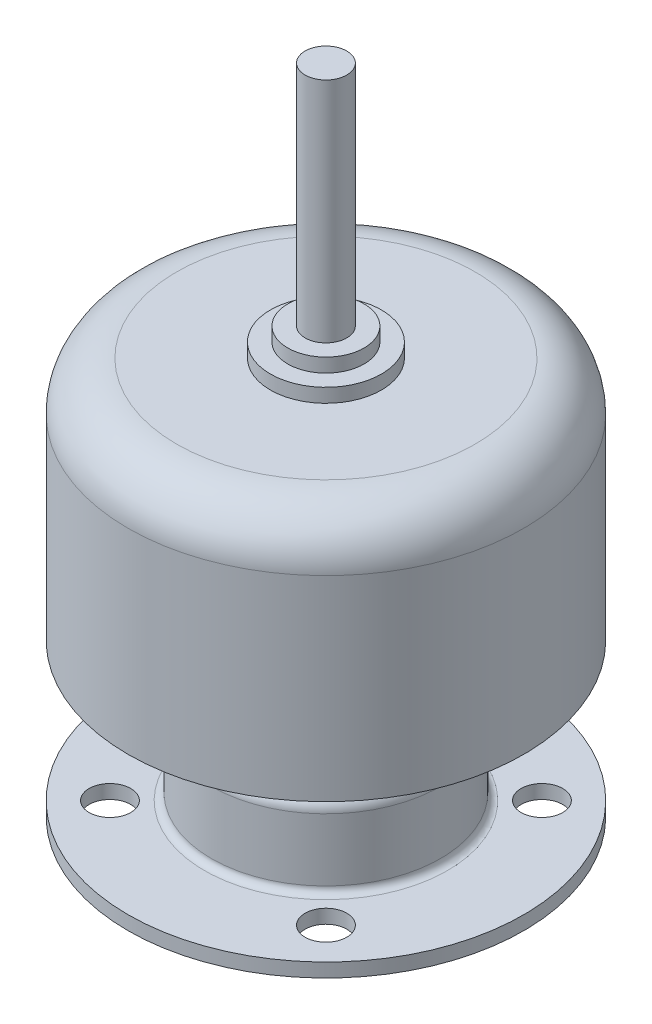
ISO-10303-21;
HEADER;
FILE_DESCRIPTION(('STEP AP214'),'2;1');
FILE_NAME('part.step','',(''),(''),'','','');
FILE_SCHEMA(('AUTOMOTIVE_DESIGN { 1 0 10303 214 1 1 1 1 }'));
ENDSEC;
DATA;
#1=APPLICATION_CONTEXT('core data for automotive mechanical design processes');
#2=APPLICATION_PROTOCOL_DEFINITION('international standard','automotive_design',2000,#1);
#3=PRODUCT_CONTEXT('',#1,'mechanical');
#4=PRODUCT('Part','Part','',(#3));
#5=PRODUCT_RELATED_PRODUCT_CATEGORY('part','',(#4));
#6=PRODUCT_DEFINITION_FORMATION('','',#4);
#7=PRODUCT_DEFINITION_CONTEXT('part definition',#1,'design');
#8=PRODUCT_DEFINITION('design','',#6,#7);
#9=PRODUCT_DEFINITION_SHAPE('','',#8);
#10=(LENGTH_UNIT() NAMED_UNIT(*) SI_UNIT(.MILLI.,.METRE.));
#11=(NAMED_UNIT(*) PLANE_ANGLE_UNIT() SI_UNIT($,.RADIAN.));
#12=(NAMED_UNIT(*) SI_UNIT($,.STERADIAN.) SOLID_ANGLE_UNIT());
#13=UNCERTAINTY_MEASURE_WITH_UNIT(LENGTH_MEASURE(1.E-05),#10,'distance_accuracy_value','');
#14=(GEOMETRIC_REPRESENTATION_CONTEXT(3) GLOBAL_UNCERTAINTY_ASSIGNED_CONTEXT((#13)) GLOBAL_UNIT_ASSIGNED_CONTEXT((#10,
#11,#12)) REPRESENTATION_CONTEXT('',''));
#15=CARTESIAN_POINT('',(0.,0.,0.));
#16=DIRECTION('',(0.,0.,1.));
#17=DIRECTION('',(1.,0.,0.));
#18=AXIS2_PLACEMENT_3D('',#15,#16,#17);
#19=CARTESIAN_POINT('',(0.,11.,0.));
#20=DIRECTION('',(0.,-1.,0.));
#21=DIRECTION('',(0.,0.,-1.));
#22=AXIS2_PLACEMENT_3D('',#19,#20,#21);
#23=PLANE('',#22);
#24=CARTESIAN_POINT('',(0.,11.,0.));
#25=DIRECTION('',(0.,-1.,0.));
#26=DIRECTION('',(0.,0.,-1.));
#27=AXIS2_PLACEMENT_3D('',#24,#25,#26);
#28=CIRCLE('',#27,6.5);
#29=CARTESIAN_POINT('',(0.,11.,6.5));
#30=VERTEX_POINT('',#29);
#31=EDGE_CURVE('E227',#30,#30,#28,.T.);
#32=ORIENTED_EDGE('',*,*,#31,.F.);
#33=EDGE_LOOP('',(#32));
#34=FACE_BOUND('',#33,.T.);
#35=CARTESIAN_POINT('',(0.,11.,0.));
#36=DIRECTION('',(0.,-1.,0.));
#37=DIRECTION('',(0.,0.,-1.));
#38=AXIS2_PLACEMENT_3D('',#35,#36,#37);
#39=CIRCLE('',#38,14.25);
#40=CARTESIAN_POINT('',(0.,11.,14.25));
#41=VERTEX_POINT('',#40);
#42=EDGE_CURVE('E308',#41,#41,#39,.T.);
#43=ORIENTED_EDGE('',*,*,#42,.T.);
#44=EDGE_LOOP('',(#43));
#45=FACE_BOUND('',#44,.T.);
#46=ADVANCED_FACE('F16',(#34,#45),#23,.T.);
#47=CARTESIAN_POINT('',(0.,7.,0.));
#48=DIRECTION('',(0.,1.,0.));
#49=DIRECTION('',(1.,0.,0.));
#50=AXIS2_PLACEMENT_3D('',#47,#48,#49);
#51=PLANE('',#50);
#52=CARTESIAN_POINT('',(0.,7.,0.));
#53=DIRECTION('',(0.,-1.,0.));
#54=DIRECTION('',(0.,0.,-1.));
#55=AXIS2_PLACEMENT_3D('',#52,#53,#54);
#56=CIRCLE('',#55,6.5);
#57=CARTESIAN_POINT('',(0.,7.,6.5));
#58=VERTEX_POINT('',#57);
#59=EDGE_CURVE('E236',#58,#58,#56,.T.);
#60=ORIENTED_EDGE('',*,*,#59,.T.);
#61=EDGE_LOOP('',(#60));
#62=FACE_BOUND('',#61,.T.);
#63=CARTESIAN_POINT('',(0.,7.,0.));
#64=DIRECTION('',(0.,1.,0.));
#65=DIRECTION('',(0.,0.,1.));
#66=AXIS2_PLACEMENT_3D('',#63,#64,#65);
#67=CIRCLE('',#66,7.25);
#68=CARTESIAN_POINT('',(0.,7.,-7.25));
#69=VERTEX_POINT('',#68);
#70=EDGE_CURVE('E186',#69,#69,#67,.T.);
#71=ORIENTED_EDGE('',*,*,#70,.T.);
#72=EDGE_LOOP('',(#71));
#73=FACE_BOUND('',#72,.T.);
#74=ADVANCED_FACE('F367',(#62,#73),#51,.T.);
#75=CARTESIAN_POINT('',(0.,1.,0.));
#76=DIRECTION('',(0.,1.,0.));
#77=DIRECTION('',(1.,0.,0.));
#78=AXIS2_PLACEMENT_3D('',#75,#76,#77);
#79=PLANE('',#78);
#80=CARTESIAN_POINT('',(7.77817459305201,1.,-7.77817459305198));
#81=DIRECTION('',(0.,1.,0.));
#82=DIRECTION('',(0.,0.,1.));
#83=AXIS2_PLACEMENT_3D('',#80,#81,#82);
#84=CIRCLE('',#83,1.50000000000005);
#85=CARTESIAN_POINT('',(7.77817459305201,1.,-6.27817459305193));
#86=VERTEX_POINT('',#85);
#87=EDGE_CURVE('E320',#86,#86,#84,.T.);
#88=ORIENTED_EDGE('',*,*,#87,.F.);
#89=EDGE_LOOP('',(#88));
#90=FACE_BOUND('',#89,.T.);
#91=CARTESIAN_POINT('',(-7.77817459305201,1.,7.77817459305203));
#92=DIRECTION('',(0.,1.,0.));
#93=DIRECTION('',(0.,0.,1.));
#94=AXIS2_PLACEMENT_3D('',#91,#92,#93);
#95=CIRCLE('',#94,1.50000000000004);
#96=CARTESIAN_POINT('',(-7.77817459305201,1.,9.27817459305207));
#97=VERTEX_POINT('',#96);
#98=EDGE_CURVE('E208',#97,#97,#95,.T.);
#99=ORIENTED_EDGE('',*,*,#98,.F.);
#100=EDGE_LOOP('',(#99));
#101=FACE_BOUND('',#100,.T.);
#102=CARTESIAN_POINT('',(-7.77817459305201,1.,-7.77817459305198));
#103=DIRECTION('',(0.,1.,0.));
#104=DIRECTION('',(0.,0.,1.));
#105=AXIS2_PLACEMENT_3D('',#102,#103,#104);
#106=CIRCLE('',#105,1.50000000000005);
#107=CARTESIAN_POINT('',(-7.77817459305201,1.,-6.27817459305193));
#108=VERTEX_POINT('',#107);
#109=EDGE_CURVE('E295',#108,#108,#106,.T.);
#110=ORIENTED_EDGE('',*,*,#109,.F.);
#111=EDGE_LOOP('',(#110));
#112=FACE_BOUND('',#111,.T.);
#113=CARTESIAN_POINT('',(7.77817459305201,1.,7.77817459305204));
#114=DIRECTION('',(0.,1.,0.));
#115=DIRECTION('',(0.,0.,1.));
#116=AXIS2_PLACEMENT_3D('',#113,#114,#115);
#117=CIRCLE('',#116,1.5);
#118=CARTESIAN_POINT('',(7.77817459305201,1.,9.27817459305204));
#119=VERTEX_POINT('',#118);
#120=EDGE_CURVE('E181',#119,#119,#117,.T.);
#121=ORIENTED_EDGE('',*,*,#120,.F.);
#122=EDGE_LOOP('',(#121));
#123=FACE_BOUND('',#122,.T.);
#124=CARTESIAN_POINT('',(0.,1.,0.));
#125=DIRECTION('',(0.,-1.,0.));
#126=DIRECTION('',(0.,0.,1.));
#127=AXIS2_PLACEMENT_3D('',#124,#125,#126);
#128=CIRCLE('',#127,8.75);
#129=CARTESIAN_POINT('',(0.,1.,-8.75));
#130=VERTEX_POINT('',#129);
#131=EDGE_CURVE('E192',#130,#130,#128,.T.);
#132=ORIENTED_EDGE('',*,*,#131,.T.);
#133=EDGE_LOOP('',(#132));
#134=FACE_BOUND('',#133,.T.);
#135=CARTESIAN_POINT('',(0.,1.,0.));
#136=DIRECTION('',(0.,-1.,0.));
#137=DIRECTION('',(0.,0.,-1.));
#138=AXIS2_PLACEMENT_3D('',#135,#136,#137);
#139=CIRCLE('',#138,14.25);
#140=CARTESIAN_POINT('',(0.,1.,14.25));
#141=VERTEX_POINT('',#140);
#142=EDGE_CURVE('E207',#141,#141,#139,.T.);
#143=ORIENTED_EDGE('',*,*,#142,.F.);
#144=EDGE_LOOP('',(#143));
#145=FACE_BOUND('',#144,.T.);
#146=ADVANCED_FACE('F18',(#90,#101,#112,#123,#134,#145),#79,.T.);
#147=CARTESIAN_POINT('',(0.,0.,0.));
#148=DIRECTION('',(0.,-1.,0.));
#149=DIRECTION('',(0.,0.,-1.));
#150=AXIS2_PLACEMENT_3D('',#147,#148,#149);
#151=PLANE('',#150);
#152=CARTESIAN_POINT('',(7.77817459305201,0.,-7.77817459305198));
#153=DIRECTION('',(0.,-1.,0.));
#154=DIRECTION('',(0.,0.,-1.));
#155=AXIS2_PLACEMENT_3D('',#152,#153,#154);
#156=CIRCLE('',#155,1.50000000000005);
#157=CARTESIAN_POINT('',(7.77817459305201,0.,-6.27817459305193));
#158=VERTEX_POINT('',#157);
#159=EDGE_CURVE('E221',#158,#158,#156,.T.);
#160=ORIENTED_EDGE('',*,*,#159,.F.);
#161=EDGE_LOOP('',(#160));
#162=FACE_BOUND('',#161,.T.);
#163=CARTESIAN_POINT('',(-7.77817459305201,0.,7.77817459305203));
#164=DIRECTION('',(0.,-1.,0.));
#165=DIRECTION('',(0.,0.,-1.));
#166=AXIS2_PLACEMENT_3D('',#163,#164,#165);
#167=CIRCLE('',#166,1.50000000000004);
#168=CARTESIAN_POINT('',(-7.77817459305201,0.,9.27817459305207));
#169=VERTEX_POINT('',#168);
#170=EDGE_CURVE('E240',#169,#169,#167,.T.);
#171=ORIENTED_EDGE('',*,*,#170,.F.);
#172=EDGE_LOOP('',(#171));
#173=FACE_BOUND('',#172,.T.);
#174=CARTESIAN_POINT('',(-7.77817459305201,0.,-7.77817459305198));
#175=DIRECTION('',(0.,-1.,0.));
#176=DIRECTION('',(0.,0.,-1.));
#177=AXIS2_PLACEMENT_3D('',#174,#175,#176);
#178=CIRCLE('',#177,1.50000000000005);
#179=CARTESIAN_POINT('',(-7.77817459305201,0.,-6.27817459305193));
#180=VERTEX_POINT('',#179);
#181=EDGE_CURVE('E212',#180,#180,#178,.T.);
#182=ORIENTED_EDGE('',*,*,#181,.F.);
#183=EDGE_LOOP('',(#182));
#184=FACE_BOUND('',#183,.T.);
#185=CARTESIAN_POINT('',(7.77817459305201,0.,7.77817459305204));
#186=DIRECTION('',(0.,-1.,0.));
#187=DIRECTION('',(0.,0.,-1.));
#188=AXIS2_PLACEMENT_3D('',#185,#186,#187);
#189=CIRCLE('',#188,1.5);
#190=CARTESIAN_POINT('',(7.77817459305201,0.,9.27817459305204));
#191=VERTEX_POINT('',#190);
#192=EDGE_CURVE('E154',#191,#191,#189,.T.);
#193=ORIENTED_EDGE('',*,*,#192,.F.);
#194=EDGE_LOOP('',(#193));
#195=FACE_BOUND('',#194,.T.);
#196=CARTESIAN_POINT('',(0.,0.,0.));
#197=DIRECTION('',(0.,-1.,0.));
#198=DIRECTION('',(0.,0.,-1.));
#199=AXIS2_PLACEMENT_3D('',#196,#197,#198);
#200=CIRCLE('',#199,14.25);
#201=CARTESIAN_POINT('',(0.,0.,14.25));
#202=VERTEX_POINT('',#201);
#203=EDGE_CURVE('E222',#202,#202,#200,.T.);
#204=ORIENTED_EDGE('',*,*,#203,.T.);
#205=EDGE_LOOP('',(#204));
#206=FACE_BOUND('',#205,.T.);
#207=ADVANCED_FACE('F341',(#162,#173,#184,#195,#206),#151,.T.);
#208=CARTESIAN_POINT('',(0.,47.,0.));
#209=DIRECTION('',(0.,1.,0.));
#210=DIRECTION('',(1.,0.,0.));
#211=AXIS2_PLACEMENT_3D('',#208,#209,#210);
#212=PLANE('',#211);
#213=CARTESIAN_POINT('',(0.,47.,0.));
#214=DIRECTION('',(0.,-1.,0.));
#215=DIRECTION('',(0.,0.,-1.));
#216=AXIS2_PLACEMENT_3D('',#213,#214,#215);
#217=CIRCLE('',#216,1.5);
#218=CARTESIAN_POINT('',(0.,47.,1.5));
#219=VERTEX_POINT('',#218);
#220=EDGE_CURVE('E257',#219,#219,#217,.T.);
#221=ORIENTED_EDGE('',*,*,#220,.F.);
#222=EDGE_LOOP('',(#221));
#223=FACE_BOUND('',#222,.T.);
#224=ADVANCED_FACE('F344',(#223),#212,.T.);
#225=CARTESIAN_POINT('',(0.,30.6,0.));
#226=DIRECTION('',(0.,1.,0.));
#227=DIRECTION('',(1.,0.,0.));
#228=AXIS2_PLACEMENT_3D('',#225,#226,#227);
#229=PLANE('',#228);
#230=CARTESIAN_POINT('',(0.,30.6,0.));
#231=DIRECTION('',(0.,-1.,0.));
#232=DIRECTION('',(0.,0.,-1.));
#233=AXIS2_PLACEMENT_3D('',#230,#231,#232);
#234=CIRCLE('',#233,1.5);
#235=CARTESIAN_POINT('',(0.,30.6,1.5));
#236=VERTEX_POINT('',#235);
#237=EDGE_CURVE('E202',#236,#236,#234,.T.);
#238=ORIENTED_EDGE('',*,*,#237,.T.);
#239=EDGE_LOOP('',(#238));
#240=FACE_BOUND('',#239,.T.);
#241=CARTESIAN_POINT('',(0.,30.6,0.));
#242=DIRECTION('',(0.,-1.,0.));
#243=DIRECTION('',(0.,0.,-1.));
#244=AXIS2_PLACEMENT_3D('',#241,#242,#243);
#245=CIRCLE('',#244,2.75);
#246=CARTESIAN_POINT('',(0.,30.6,2.75));
#247=VERTEX_POINT('',#246);
#248=EDGE_CURVE('E246',#247,#247,#245,.T.);
#249=ORIENTED_EDGE('',*,*,#248,.F.);
#250=EDGE_LOOP('',(#249));
#251=FACE_BOUND('',#250,.T.);
#252=ADVANCED_FACE('F382',(#240,#251),#229,.T.);
#253=CARTESIAN_POINT('',(0.,29.6,0.));
#254=DIRECTION('',(0.,-1.,0.));
#255=DIRECTION('',(0.,0.,-1.));
#256=AXIS2_PLACEMENT_3D('',#253,#254,#255);
#257=PLANE('',#256);
#258=CARTESIAN_POINT('',(0.,29.6,0.));
#259=DIRECTION('',(0.,-1.,0.));
#260=DIRECTION('',(0.,0.,-1.));
#261=AXIS2_PLACEMENT_3D('',#258,#259,#260);
#262=CIRCLE('',#261,2.75);
#263=CARTESIAN_POINT('',(0.,29.6,2.75));
#264=VERTEX_POINT('',#263);
#265=EDGE_CURVE('E247',#264,#264,#262,.T.);
#266=ORIENTED_EDGE('',*,*,#265,.T.);
#267=EDGE_LOOP('',(#266));
#268=FACE_BOUND('',#267,.T.);
#269=CARTESIAN_POINT('',(0.,29.6,0.));
#270=DIRECTION('',(0.,-1.,0.));
#271=DIRECTION('',(0.,0.,-1.));
#272=AXIS2_PLACEMENT_3D('',#269,#270,#271);
#273=CIRCLE('',#272,4.);
#274=CARTESIAN_POINT('',(0.,29.6,4.));
#275=VERTEX_POINT('',#274);
#276=EDGE_CURVE('E11',#275,#275,#273,.T.);
#277=ORIENTED_EDGE('',*,*,#276,.F.);
#278=EDGE_LOOP('',(#277));
#279=FACE_BOUND('',#278,.T.);
#280=ADVANCED_FACE('F384',(#268,#279),#257,.F.);
#281=CARTESIAN_POINT('',(0.,28.6,0.));
#282=DIRECTION('',(0.,-1.,0.));
#283=DIRECTION('',(0.,0.,-1.));
#284=AXIS2_PLACEMENT_3D('',#281,#282,#283);
#285=PLANE('',#284);
#286=CARTESIAN_POINT('',(0.,28.6,0.));
#287=DIRECTION('',(0.,-1.,0.));
#288=DIRECTION('',(0.,0.,-1.));
#289=AXIS2_PLACEMENT_3D('',#286,#287,#288);
#290=CIRCLE('',#289,4.);
#291=CARTESIAN_POINT('',(0.,28.6,4.));
#292=VERTEX_POINT('',#291);
#293=EDGE_CURVE('E254',#292,#292,#290,.T.);
#294=ORIENTED_EDGE('',*,*,#293,.T.);
#295=EDGE_LOOP('',(#294));
#296=FACE_BOUND('',#295,.T.);
#297=CARTESIAN_POINT('',(0.,28.6,0.));
#298=DIRECTION('',(0.,1.,0.));
#299=DIRECTION('',(0.,0.,-1.));
#300=AXIS2_PLACEMENT_3D('',#297,#298,#299);
#301=CIRCLE('',#300,10.75);
#302=CARTESIAN_POINT('',(0.,28.6,10.75));
#303=VERTEX_POINT('',#302);
#304=EDGE_CURVE('E302',#303,#303,#301,.T.);
#305=ORIENTED_EDGE('',*,*,#304,.T.);
#306=EDGE_LOOP('',(#305));
#307=FACE_BOUND('',#306,.T.);
#308=ADVANCED_FACE('F411',(#296,#307),#285,.F.);
#309=CARTESIAN_POINT('',(0.,0.,0.));
#310=DIRECTION('',(0.,-1.,0.));
#311=DIRECTION('',(0.,0.,-1.));
#312=AXIS2_PLACEMENT_3D('',#309,#310,#311);
#313=CYLINDRICAL_SURFACE('',#312,4.);
#314=ORIENTED_EDGE('',*,*,#293,.F.);
#315=DIRECTION('',(0.,1.,0.));
#316=VECTOR('',#315,1.);
#317=CARTESIAN_POINT('',(0.,0.,4.));
#318=LINE('',#317,#316);
#319=EDGE_CURVE('E27',#292,#275,#318,.T.);
#320=ORIENTED_EDGE('',*,*,#319,.T.);
#321=ORIENTED_EDGE('',*,*,#276,.T.);
#322=ORIENTED_EDGE('',*,*,#319,.F.);
#323=EDGE_LOOP('',(#314,#320,#321,#322));
#324=FACE_BOUND('',#323,.T.);
#325=ADVANCED_FACE('F400',(#324),#313,.T.);
#326=CARTESIAN_POINT('',(0.,0.,0.));
#327=DIRECTION('',(0.,-1.,0.));
#328=DIRECTION('',(0.,0.,-1.));
#329=AXIS2_PLACEMENT_3D('',#326,#327,#328);
#330=CYLINDRICAL_SURFACE('',#329,2.75);
#331=ORIENTED_EDGE('',*,*,#265,.F.);
#332=DIRECTION('',(0.,1.,0.));
#333=VECTOR('',#332,1.);
#334=CARTESIAN_POINT('',(0.,0.,2.75));
#335=LINE('',#334,#333);
#336=EDGE_CURVE('E243',#264,#247,#335,.T.);
#337=ORIENTED_EDGE('',*,*,#336,.T.);
#338=ORIENTED_EDGE('',*,*,#248,.T.);
#339=ORIENTED_EDGE('',*,*,#336,.F.);
#340=EDGE_LOOP('',(#331,#337,#338,#339));
#341=FACE_BOUND('',#340,.T.);
#342=ADVANCED_FACE('F361',(#341),#330,.T.);
#343=CARTESIAN_POINT('',(0.,0.,0.));
#344=DIRECTION('',(0.,-1.,0.));
#345=DIRECTION('',(0.,0.,-1.));
#346=AXIS2_PLACEMENT_3D('',#343,#344,#345);
#347=CYLINDRICAL_SURFACE('',#346,1.5);
#348=ORIENTED_EDGE('',*,*,#237,.F.);
#349=DIRECTION('',(0.,1.,0.));
#350=VECTOR('',#349,1.);
#351=CARTESIAN_POINT('',(0.,0.,1.5));
#352=LINE('',#351,#350);
#353=EDGE_CURVE('E206',#236,#219,#352,.T.);
#354=ORIENTED_EDGE('',*,*,#353,.T.);
#355=ORIENTED_EDGE('',*,*,#220,.T.);
#356=ORIENTED_EDGE('',*,*,#353,.F.);
#357=EDGE_LOOP('',(#348,#354,#355,#356));
#358=FACE_BOUND('',#357,.T.);
#359=ADVANCED_FACE('F352',(#358),#347,.T.);
#360=CARTESIAN_POINT('',(0.,0.,0.));
#361=DIRECTION('',(0.,-1.,0.));
#362=DIRECTION('',(0.,0.,-1.));
#363=AXIS2_PLACEMENT_3D('',#360,#361,#362);
#364=CYLINDRICAL_SURFACE('',#363,14.25);
#365=ORIENTED_EDGE('',*,*,#203,.F.);
#366=DIRECTION('',(0.,1.,0.));
#367=VECTOR('',#366,1.);
#368=CARTESIAN_POINT('',(0.,0.,14.25));
#369=LINE('',#368,#367);
#370=EDGE_CURVE('E225',#202,#141,#369,.T.);
#371=ORIENTED_EDGE('',*,*,#370,.T.);
#372=ORIENTED_EDGE('',*,*,#142,.T.);
#373=ORIENTED_EDGE('',*,*,#370,.F.);
#374=EDGE_LOOP('',(#365,#371,#372,#373));
#375=FACE_BOUND('',#374,.T.);
#376=ADVANCED_FACE('F350',(#375),#364,.T.);
#377=CARTESIAN_POINT('',(0.,0.,0.));
#378=DIRECTION('',(0.,-1.,0.));
#379=DIRECTION('',(0.,0.,-1.));
#380=AXIS2_PLACEMENT_3D('',#377,#378,#379);
#381=CYLINDRICAL_SURFACE('',#380,8.25);
#382=CARTESIAN_POINT('',(0.,1.5,0.));
#383=DIRECTION('',(0.,1.,0.));
#384=DIRECTION('',(0.,0.,1.));
#385=AXIS2_PLACEMENT_3D('',#382,#383,#384);
#386=CIRCLE('',#385,8.25);
#387=CARTESIAN_POINT('',(0.,1.5,8.25));
#388=VERTEX_POINT('',#387);
#389=CARTESIAN_POINT('',(0.,1.5,-8.25));
#390=VERTEX_POINT('',#389);
#391=EDGE_CURVE('E283',#388,#390,#386,.T.);
#392=ORIENTED_EDGE('',*,*,#391,.T.);
#393=CARTESIAN_POINT('',(0.,1.5,0.));
#394=DIRECTION('',(0.,1.,0.));
#395=DIRECTION('',(0.,0.,1.));
#396=AXIS2_PLACEMENT_3D('',#393,#394,#395);
#397=CIRCLE('',#396,8.25);
#398=EDGE_CURVE('E216',#390,#388,#397,.T.);
#399=ORIENTED_EDGE('',*,*,#398,.T.);
#400=DIRECTION('',(0.,1.,0.));
#401=VECTOR('',#400,1.);
#402=CARTESIAN_POINT('',(0.,0.,8.25));
#403=LINE('',#402,#401);
#404=CARTESIAN_POINT('',(0.,6.,8.25));
#405=VERTEX_POINT('',#404);
#406=EDGE_CURVE('E129',#388,#405,#403,.T.);
#407=ORIENTED_EDGE('',*,*,#406,.T.);
#408=CARTESIAN_POINT('',(0.,6.,0.));
#409=DIRECTION('',(0.,-1.,0.));
#410=DIRECTION('',(0.,0.,1.));
#411=AXIS2_PLACEMENT_3D('',#408,#409,#410);
#412=CIRCLE('',#411,8.25);
#413=CARTESIAN_POINT('',(0.,6.,-8.25));
#414=VERTEX_POINT('',#413);
#415=EDGE_CURVE('E179',#405,#414,#412,.T.);
#416=ORIENTED_EDGE('',*,*,#415,.T.);
#417=CARTESIAN_POINT('',(0.,6.,0.));
#418=DIRECTION('',(0.,-1.,0.));
#419=DIRECTION('',(0.,0.,1.));
#420=AXIS2_PLACEMENT_3D('',#417,#418,#419);
#421=CIRCLE('',#420,8.25);
#422=EDGE_CURVE('E176',#414,#405,#421,.T.);
#423=ORIENTED_EDGE('',*,*,#422,.T.);
#424=ORIENTED_EDGE('',*,*,#406,.F.);
#425=EDGE_LOOP('',(#392,#399,#407,#416,#423,#424));
#426=FACE_BOUND('',#425,.T.);
#427=ADVANCED_FACE('F183',(#426),#381,.T.);
#428=CARTESIAN_POINT('',(0.,0.,0.));
#429=DIRECTION('',(0.,-1.,0.));
#430=DIRECTION('',(0.,0.,-1.));
#431=AXIS2_PLACEMENT_3D('',#428,#429,#430);
#432=CYLINDRICAL_SURFACE('',#431,6.5);
#433=ORIENTED_EDGE('',*,*,#59,.F.);
#434=DIRECTION('',(0.,1.,0.));
#435=VECTOR('',#434,1.);
#436=CARTESIAN_POINT('',(0.,0.,6.5));
#437=LINE('',#436,#435);
#438=EDGE_CURVE('E84',#58,#30,#437,.T.);
#439=ORIENTED_EDGE('',*,*,#438,.T.);
#440=ORIENTED_EDGE('',*,*,#31,.T.);
#441=ORIENTED_EDGE('',*,*,#438,.F.);
#442=EDGE_LOOP('',(#433,#439,#440,#441));
#443=FACE_BOUND('',#442,.T.);
#444=ADVANCED_FACE('F359',(#443),#432,.T.);
#445=CARTESIAN_POINT('',(0.,0.,0.));
#446=DIRECTION('',(0.,-1.,0.));
#447=DIRECTION('',(0.,0.,-1.));
#448=AXIS2_PLACEMENT_3D('',#445,#446,#447);
#449=CYLINDRICAL_SURFACE('',#448,14.25);
#450=ORIENTED_EDGE('',*,*,#42,.F.);
#451=DIRECTION('',(0.,1.,0.));
#452=VECTOR('',#451,1.);
#453=CARTESIAN_POINT('',(0.,0.,14.25));
#454=LINE('',#453,#452);
#455=CARTESIAN_POINT('',(0.,25.1,14.25));
#456=VERTEX_POINT('',#455);
#457=EDGE_CURVE('E100',#41,#456,#454,.T.);
#458=ORIENTED_EDGE('',*,*,#457,.T.);
#459=CARTESIAN_POINT('',(0.,25.1,0.));
#460=DIRECTION('',(0.,-1.,0.));
#461=DIRECTION('',(0.,0.,-1.));
#462=AXIS2_PLACEMENT_3D('',#459,#460,#461);
#463=CIRCLE('',#462,14.25);
#464=EDGE_CURVE('E217',#456,#456,#463,.T.);
#465=ORIENTED_EDGE('',*,*,#464,.T.);
#466=ORIENTED_EDGE('',*,*,#457,.F.);
#467=EDGE_LOOP('',(#450,#458,#465,#466));
#468=FACE_BOUND('',#467,.T.);
#469=ADVANCED_FACE('F389',(#468),#449,.T.);
#470=CARTESIAN_POINT('',(0.,25.1,0.));
#471=DIRECTION('',(0.,-1.,0.));
#472=DIRECTION('',(0.,0.,-1.));
#473=AXIS2_PLACEMENT_3D('',#470,#471,#472);
#474=TOROIDAL_SURFACE('',#473,10.75,3.5);
#475=ORIENTED_EDGE('',*,*,#464,.F.);
#476=CARTESIAN_POINT('',(0.,25.1,10.75));
#477=DIRECTION('',(-1.,0.,0.));
#478=DIRECTION('',(0.,0.,1.));
#479=AXIS2_PLACEMENT_3D('',#476,#477,#478);
#480=CIRCLE('',#479,3.5);
#481=EDGE_CURVE('E220',#456,#303,#480,.T.);
#482=ORIENTED_EDGE('',*,*,#481,.T.);
#483=ORIENTED_EDGE('',*,*,#304,.F.);
#484=ORIENTED_EDGE('',*,*,#481,.F.);
#485=EDGE_LOOP('',(#475,#482,#483,#484));
#486=FACE_BOUND('',#485,.T.);
#487=ADVANCED_FACE('F381',(#486),#474,.T.);
#488=CARTESIAN_POINT('',(7.77817459305201,10.,-7.77817459305198));
#489=DIRECTION('',(0.,-1.,0.));
#490=DIRECTION('',(0.,0.,-1.));
#491=AXIS2_PLACEMENT_3D('',#488,#489,#490);
#492=CYLINDRICAL_SURFACE('',#491,1.50000000000005);
#493=ORIENTED_EDGE('',*,*,#87,.T.);
#494=DIRECTION('',(0.,-1.,0.));
#495=VECTOR('',#494,1.);
#496=CARTESIAN_POINT('',(7.77817459305201,10.,-6.27817459305193));
#497=LINE('',#496,#495);
#498=EDGE_CURVE('E317',#86,#158,#497,.T.);
#499=ORIENTED_EDGE('',*,*,#498,.T.);
#500=ORIENTED_EDGE('',*,*,#159,.T.);
#501=ORIENTED_EDGE('',*,*,#498,.F.);
#502=EDGE_LOOP('',(#493,#499,#500,#501));
#503=FACE_BOUND('',#502,.T.);
#504=ADVANCED_FACE('F378',(#503),#492,.F.);
#505=CARTESIAN_POINT('',(-7.77817459305201,10.,7.77817459305203));
#506=DIRECTION('',(0.,-1.,0.));
#507=DIRECTION('',(0.,0.,-1.));
#508=AXIS2_PLACEMENT_3D('',#505,#506,#507);
#509=CYLINDRICAL_SURFACE('',#508,1.50000000000004);
#510=ORIENTED_EDGE('',*,*,#98,.T.);
#511=DIRECTION('',(0.,-1.,0.));
#512=VECTOR('',#511,1.);
#513=CARTESIAN_POINT('',(-7.77817459305201,10.,9.27817459305207));
#514=LINE('',#513,#512);
#515=EDGE_CURVE('E211',#97,#169,#514,.T.);
#516=ORIENTED_EDGE('',*,*,#515,.T.);
#517=ORIENTED_EDGE('',*,*,#170,.T.);
#518=ORIENTED_EDGE('',*,*,#515,.F.);
#519=EDGE_LOOP('',(#510,#516,#517,#518));
#520=FACE_BOUND('',#519,.T.);
#521=ADVANCED_FACE('F339',(#520),#509,.F.);
#522=CARTESIAN_POINT('',(-7.77817459305201,10.,-7.77817459305198));
#523=DIRECTION('',(0.,-1.,0.));
#524=DIRECTION('',(0.,0.,-1.));
#525=AXIS2_PLACEMENT_3D('',#522,#523,#524);
#526=CYLINDRICAL_SURFACE('',#525,1.50000000000005);
#527=ORIENTED_EDGE('',*,*,#109,.T.);
#528=DIRECTION('',(0.,-1.,0.));
#529=VECTOR('',#528,1.);
#530=CARTESIAN_POINT('',(-7.77817459305201,10.,-6.27817459305193));
#531=LINE('',#530,#529);
#532=EDGE_CURVE('E291',#108,#180,#531,.T.);
#533=ORIENTED_EDGE('',*,*,#532,.T.);
#534=ORIENTED_EDGE('',*,*,#181,.T.);
#535=ORIENTED_EDGE('',*,*,#532,.F.);
#536=EDGE_LOOP('',(#527,#533,#534,#535));
#537=FACE_BOUND('',#536,.T.);
#538=ADVANCED_FACE('F398',(#537),#526,.F.);
#539=CARTESIAN_POINT('',(7.77817459305201,10.,7.77817459305204));
#540=DIRECTION('',(0.,-1.,0.));
#541=DIRECTION('',(0.,0.,-1.));
#542=AXIS2_PLACEMENT_3D('',#539,#540,#541);
#543=CYLINDRICAL_SURFACE('',#542,1.5);
#544=ORIENTED_EDGE('',*,*,#120,.T.);
#545=DIRECTION('',(0.,-1.,0.));
#546=VECTOR('',#545,1.);
#547=CARTESIAN_POINT('',(7.77817459305201,10.,9.27817459305204));
#548=LINE('',#547,#546);
#549=EDGE_CURVE('E161',#119,#191,#548,.T.);
#550=ORIENTED_EDGE('',*,*,#549,.T.);
#551=ORIENTED_EDGE('',*,*,#192,.T.);
#552=ORIENTED_EDGE('',*,*,#549,.F.);
#553=EDGE_LOOP('',(#544,#550,#551,#552));
#554=FACE_BOUND('',#553,.T.);
#555=ADVANCED_FACE('F395',(#554),#543,.F.);
#556=CARTESIAN_POINT('',(0.,6.,0.));
#557=DIRECTION('',(0.,1.,0.));
#558=DIRECTION('',(0.,0.,1.));
#559=AXIS2_PLACEMENT_3D('',#556,#557,#558);
#560=TOROIDAL_SURFACE('',#559,7.25,1.);
#561=ORIENTED_EDGE('',*,*,#70,.F.);
#562=CARTESIAN_POINT('',(0.,6.,-7.25));
#563=DIRECTION('',(-1.,0.,0.));
#564=DIRECTION('',(0.,0.,-1.));
#565=AXIS2_PLACEMENT_3D('',#562,#563,#564);
#566=CIRCLE('',#565,1.);
#567=EDGE_CURVE('E20',#69,#414,#566,.T.);
#568=ORIENTED_EDGE('',*,*,#567,.T.);
#569=ORIENTED_EDGE('',*,*,#415,.F.);
#570=ORIENTED_EDGE('',*,*,#422,.F.);
#571=ORIENTED_EDGE('',*,*,#567,.F.);
#572=EDGE_LOOP('',(#561,#568,#569,#570,#571));
#573=FACE_BOUND('',#572,.T.);
#574=ADVANCED_FACE('F178',(#573),#560,.T.);
#575=CARTESIAN_POINT('',(0.,1.5,0.));
#576=DIRECTION('',(0.,1.,0.));
#577=DIRECTION('',(0.,0.,1.));
#578=AXIS2_PLACEMENT_3D('',#575,#576,#577);
#579=TOROIDAL_SURFACE('',#578,8.75,0.5);
#580=ORIENTED_EDGE('',*,*,#391,.F.);
#581=ORIENTED_EDGE('',*,*,#398,.F.);
#582=CARTESIAN_POINT('',(0.,1.5,-8.75));
#583=DIRECTION('',(1.,0.,0.));
#584=DIRECTION('',(0.,0.,-1.));
#585=AXIS2_PLACEMENT_3D('',#582,#583,#584);
#586=CIRCLE('',#585,0.5);
#587=EDGE_CURVE('E114',#390,#130,#586,.T.);
#588=ORIENTED_EDGE('',*,*,#587,.T.);
#589=ORIENTED_EDGE('',*,*,#131,.F.);
#590=ORIENTED_EDGE('',*,*,#587,.F.);
#591=EDGE_LOOP('',(#580,#581,#588,#589,#590));
#592=FACE_BOUND('',#591,.T.);
#593=ADVANCED_FACE('F402',(#592),#579,.F.);
#594=CLOSED_SHELL('',(#46,#74,#146,#207,#224,#252,#280,#308,#325,#342,#359,#376,#427,#444,#469,
#487,#504,#521,#538,#555,#574,#593));
#595=MANIFOLD_SOLID_BREP('B1',#594);
#596=ADVANCED_BREP_SHAPE_REPRESENTATION('',(#18,#595),#14);
#597=SHAPE_DEFINITION_REPRESENTATION(#9,#596);
ENDSEC;
END-ISO-10303-21;
